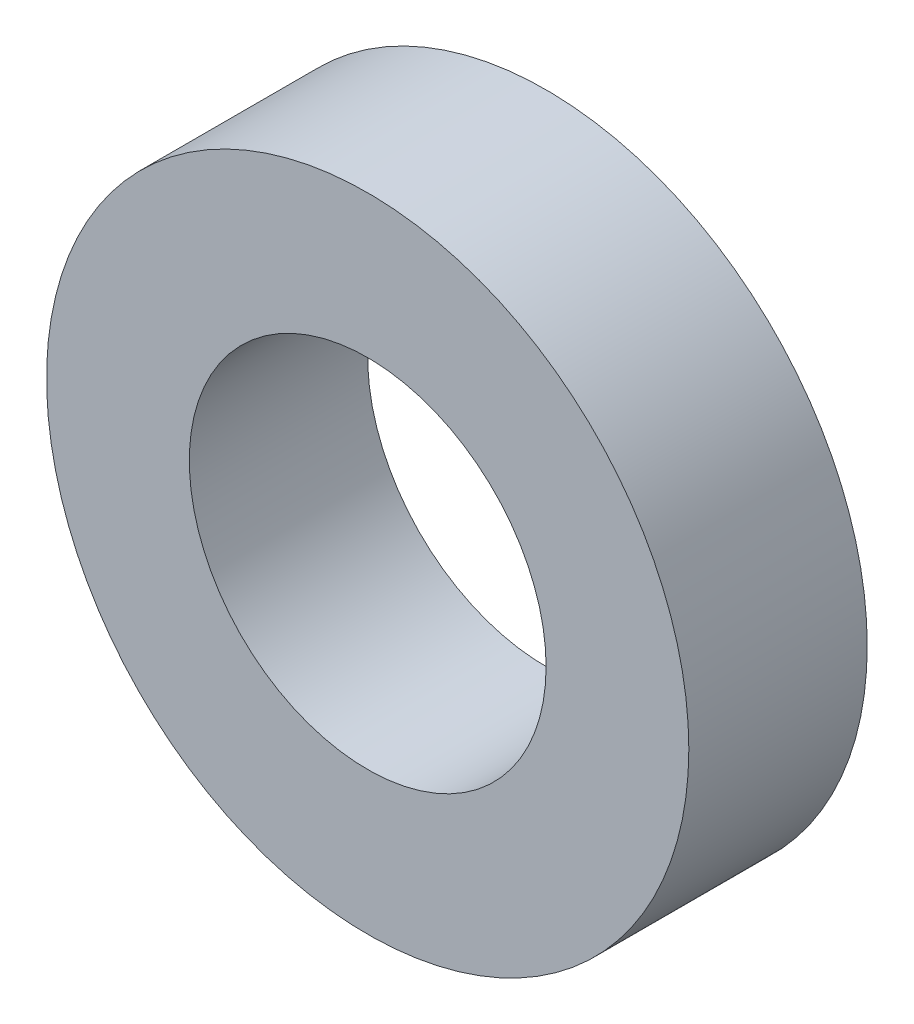
ISO-10303-21;
HEADER;
FILE_DESCRIPTION(('STEP AP214'),'2;1');
FILE_NAME('part.step','',(''),(''),'','','');
FILE_SCHEMA(('AUTOMOTIVE_DESIGN { 1 0 10303 214 1 1 1 1 }'));
ENDSEC;
DATA;
#1=APPLICATION_CONTEXT('core data for automotive mechanical design processes');
#2=APPLICATION_PROTOCOL_DEFINITION('international standard','automotive_design',2000,#1);
#3=PRODUCT_CONTEXT('',#1,'mechanical');
#4=PRODUCT('Part','Part','',(#3));
#5=PRODUCT_RELATED_PRODUCT_CATEGORY('part','',(#4));
#6=PRODUCT_DEFINITION_FORMATION('','',#4);
#7=PRODUCT_DEFINITION_CONTEXT('part definition',#1,'design');
#8=PRODUCT_DEFINITION('design','',#6,#7);
#9=PRODUCT_DEFINITION_SHAPE('','',#8);
#10=(LENGTH_UNIT() NAMED_UNIT(*) SI_UNIT(.MILLI.,.METRE.));
#11=(NAMED_UNIT(*) PLANE_ANGLE_UNIT() SI_UNIT($,.RADIAN.));
#12=(NAMED_UNIT(*) SI_UNIT($,.STERADIAN.) SOLID_ANGLE_UNIT());
#13=UNCERTAINTY_MEASURE_WITH_UNIT(LENGTH_MEASURE(1.E-05),#10,'distance_accuracy_value','');
#14=(GEOMETRIC_REPRESENTATION_CONTEXT(3) GLOBAL_UNCERTAINTY_ASSIGNED_CONTEXT((#13)) GLOBAL_UNIT_ASSIGNED_CONTEXT((#10,
#11,#12)) REPRESENTATION_CONTEXT('',''));
#15=CARTESIAN_POINT('',(0.,0.,0.));
#16=DIRECTION('',(0.,0.,1.));
#17=DIRECTION('',(1.,0.,0.));
#18=AXIS2_PLACEMENT_3D('',#15,#16,#17);
#19=CARTESIAN_POINT('',(0.,0.,15.));
#20=DIRECTION('',(0.,0.,1.));
#21=DIRECTION('',(1.,0.,0.));
#22=AXIS2_PLACEMENT_3D('',#19,#20,#21);
#23=PLANE('',#22);
#24=CARTESIAN_POINT('',(0.,0.,15.));
#25=DIRECTION('',(0.,0.,1.));
#26=DIRECTION('',(1.,0.,0.));
#27=AXIS2_PLACEMENT_3D('',#24,#25,#26);
#28=CIRCLE('',#27,27.);
#29=CARTESIAN_POINT('',(27.,0.,15.));
#30=VERTEX_POINT('',#29);
#31=EDGE_CURVE('E10',#30,#30,#28,.T.);
#32=ORIENTED_EDGE('',*,*,#31,.T.);
#33=EDGE_LOOP('',(#32));
#34=FACE_BOUND('',#33,.T.);
#35=CARTESIAN_POINT('',(0.,0.,15.));
#36=DIRECTION('',(0.,0.,1.));
#37=DIRECTION('',(1.,0.,0.));
#38=AXIS2_PLACEMENT_3D('',#35,#36,#37);
#39=CIRCLE('',#38,15.);
#40=CARTESIAN_POINT('',(15.,0.,15.));
#41=VERTEX_POINT('',#40);
#42=EDGE_CURVE('E41',#41,#41,#39,.T.);
#43=ORIENTED_EDGE('',*,*,#42,.F.);
#44=EDGE_LOOP('',(#43));
#45=FACE_BOUND('',#44,.T.);
#46=ADVANCED_FACE('F30',(#34,#45),#23,.T.);
#47=CARTESIAN_POINT('',(0.,0.,0.));
#48=DIRECTION('',(0.,0.,1.));
#49=DIRECTION('',(1.,0.,0.));
#50=AXIS2_PLACEMENT_3D('',#47,#48,#49);
#51=PLANE('',#50);
#52=CARTESIAN_POINT('',(0.,0.,0.));
#53=DIRECTION('',(0.,0.,1.));
#54=DIRECTION('',(1.,0.,0.));
#55=AXIS2_PLACEMENT_3D('',#52,#53,#54);
#56=CIRCLE('',#55,27.);
#57=CARTESIAN_POINT('',(27.,0.,0.));
#58=VERTEX_POINT('',#57);
#59=EDGE_CURVE('E34',#58,#58,#56,.T.);
#60=ORIENTED_EDGE('',*,*,#59,.F.);
#61=EDGE_LOOP('',(#60));
#62=FACE_BOUND('',#61,.T.);
#63=CARTESIAN_POINT('',(0.,0.,0.));
#64=DIRECTION('',(0.,0.,1.));
#65=DIRECTION('',(1.,0.,0.));
#66=AXIS2_PLACEMENT_3D('',#63,#64,#65);
#67=CIRCLE('',#66,15.);
#68=CARTESIAN_POINT('',(15.,0.,0.));
#69=VERTEX_POINT('',#68);
#70=EDGE_CURVE('E43',#69,#69,#67,.T.);
#71=ORIENTED_EDGE('',*,*,#70,.T.);
#72=EDGE_LOOP('',(#71));
#73=FACE_BOUND('',#72,.T.);
#74=ADVANCED_FACE('F53',(#62,#73),#51,.F.);
#75=CARTESIAN_POINT('',(0.,0.,15.));
#76=DIRECTION('',(0.,0.,-1.));
#77=DIRECTION('',(-1.,0.,0.));
#78=AXIS2_PLACEMENT_3D('',#75,#76,#77);
#79=CYLINDRICAL_SURFACE('',#78,27.);
#80=ORIENTED_EDGE('',*,*,#31,.F.);
#81=EDGE_LOOP('',(#80));
#82=FACE_BOUND('',#81,.T.);
#83=ORIENTED_EDGE('',*,*,#59,.T.);
#84=EDGE_LOOP('',(#83));
#85=FACE_BOUND('',#84,.T.);
#86=ADVANCED_FACE('F32',(#82,#85),#79,.T.);
#87=CARTESIAN_POINT('',(0.,0.,15.));
#88=DIRECTION('',(0.,0.,-1.));
#89=DIRECTION('',(-1.,0.,0.));
#90=AXIS2_PLACEMENT_3D('',#87,#88,#89);
#91=CYLINDRICAL_SURFACE('',#90,15.);
#92=ORIENTED_EDGE('',*,*,#42,.T.);
#93=EDGE_LOOP('',(#92));
#94=FACE_BOUND('',#93,.T.);
#95=ORIENTED_EDGE('',*,*,#70,.F.);
#96=EDGE_LOOP('',(#95));
#97=FACE_BOUND('',#96,.T.);
#98=ADVANCED_FACE('F49',(#94,#97),#91,.F.);
#99=CLOSED_SHELL('',(#46,#74,#86,#98));
#100=MANIFOLD_SOLID_BREP('B2',#99);
#101=ADVANCED_BREP_SHAPE_REPRESENTATION('',(#18,#100),#14);
#102=SHAPE_DEFINITION_REPRESENTATION(#9,#101);
ENDSEC;
END-ISO-10303-21;
